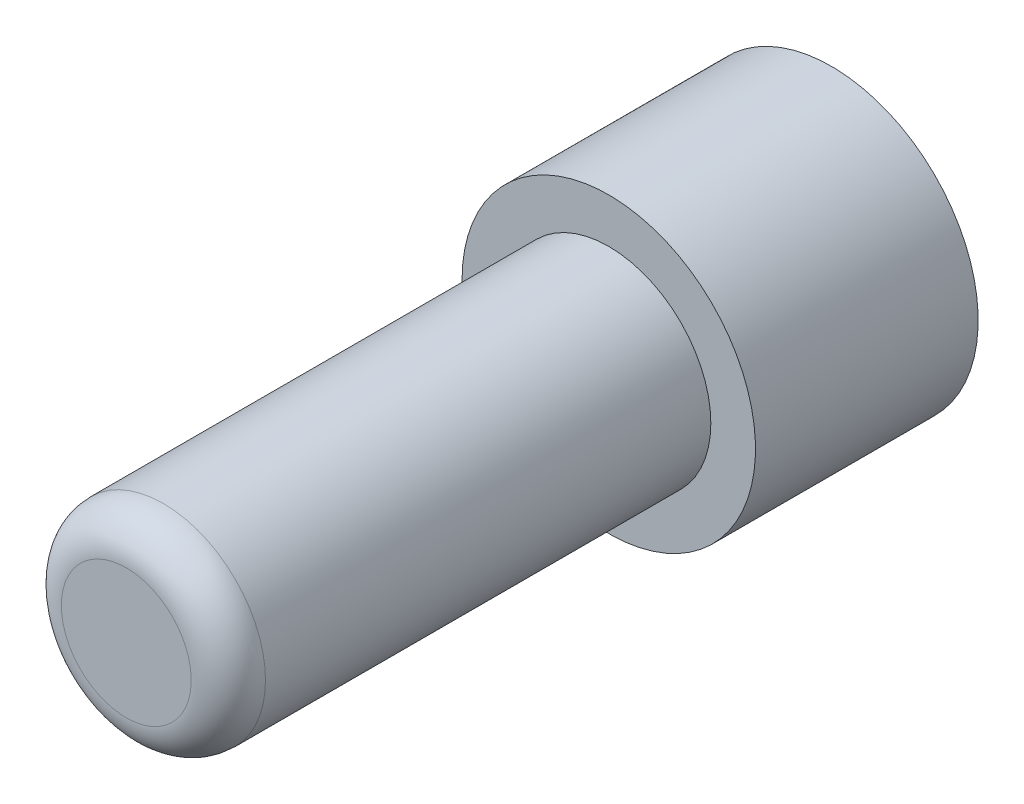
ISO-10303-21;
HEADER;
FILE_DESCRIPTION(('STEP AP214'),'2;1');
FILE_NAME('part.step','',(''),(''),'','','');
FILE_SCHEMA(('AUTOMOTIVE_DESIGN { 1 0 10303 214 1 1 1 1 }'));
ENDSEC;
DATA;
#1=APPLICATION_CONTEXT('core data for automotive mechanical design processes');
#2=APPLICATION_PROTOCOL_DEFINITION('international standard','automotive_design',2000,#1);
#3=PRODUCT_CONTEXT('',#1,'mechanical');
#4=PRODUCT('Part','Part','',(#3));
#5=PRODUCT_RELATED_PRODUCT_CATEGORY('part','',(#4));
#6=PRODUCT_DEFINITION_FORMATION('','',#4);
#7=PRODUCT_DEFINITION_CONTEXT('part definition',#1,'design');
#8=PRODUCT_DEFINITION('design','',#6,#7);
#9=PRODUCT_DEFINITION_SHAPE('','',#8);
#10=(LENGTH_UNIT() NAMED_UNIT(*) SI_UNIT(.MILLI.,.METRE.));
#11=(NAMED_UNIT(*) PLANE_ANGLE_UNIT() SI_UNIT($,.RADIAN.));
#12=(NAMED_UNIT(*) SI_UNIT($,.STERADIAN.) SOLID_ANGLE_UNIT());
#13=UNCERTAINTY_MEASURE_WITH_UNIT(LENGTH_MEASURE(1.E-05),#10,'distance_accuracy_value','');
#14=(GEOMETRIC_REPRESENTATION_CONTEXT(3) GLOBAL_UNCERTAINTY_ASSIGNED_CONTEXT((#13)) GLOBAL_UNIT_ASSIGNED_CONTEXT((#10,
#11,#12)) REPRESENTATION_CONTEXT('',''));
#15=CARTESIAN_POINT('',(0.,0.,0.));
#16=DIRECTION('',(0.,0.,1.));
#17=DIRECTION('',(1.,0.,0.));
#18=AXIS2_PLACEMENT_3D('',#15,#16,#17);
#19=CARTESIAN_POINT('',(95.8626025290754,210.063080557682,263.707141652104));
#20=DIRECTION('',(0.,0.,-1.));
#21=DIRECTION('',(-1.,0.,0.));
#22=AXIS2_PLACEMENT_3D('',#19,#20,#21);
#23=CYLINDRICAL_SURFACE('',#22,2.75000000000001);
#24=CARTESIAN_POINT('',(95.8626025290754,210.063080557682,262.707141652104));
#25=DIRECTION('',(0.,0.,-1.));
#26=DIRECTION('',(-1.,0.,0.));
#27=AXIS2_PLACEMENT_3D('',#24,#25,#26);
#28=CIRCLE('',#27,2.75000000000001);
#29=CARTESIAN_POINT('',(93.1126025290754,210.063080557682,262.707141652104));
#30=VERTEX_POINT('',#29);
#31=EDGE_CURVE('E38',#30,#30,#28,.T.);
#32=ORIENTED_EDGE('',*,*,#31,.T.);
#33=EDGE_LOOP('',(#32));
#34=FACE_BOUND('',#33,.T.);
#35=CARTESIAN_POINT('',(95.8626025290754,210.063080557682,250.707141652104));
#36=DIRECTION('',(0.,0.,-1.));
#37=DIRECTION('',(-1.,0.,0.));
#38=AXIS2_PLACEMENT_3D('',#35,#36,#37);
#39=CIRCLE('',#38,2.75000000000001);
#40=CARTESIAN_POINT('',(93.1126025290754,210.063080557682,250.707141652104));
#41=VERTEX_POINT('',#40);
#42=EDGE_CURVE('E46',#41,#41,#39,.T.);
#43=ORIENTED_EDGE('',*,*,#42,.F.);
#44=EDGE_LOOP('',(#43));
#45=FACE_BOUND('',#44,.T.);
#46=ADVANCED_FACE('F31',(#34,#45),#23,.T.);
#47=CARTESIAN_POINT('',(95.8626025290754,210.063080557682,263.707141652104));
#48=DIRECTION('',(0.,0.,-1.));
#49=DIRECTION('',(-1.,0.,0.));
#50=AXIS2_PLACEMENT_3D('',#47,#48,#49);
#51=PLANE('',#50);
#52=CARTESIAN_POINT('',(95.8626025290754,210.063080557682,263.707141652104));
#53=DIRECTION('',(0.,0.,-1.));
#54=DIRECTION('',(-1.,0.,0.));
#55=AXIS2_PLACEMENT_3D('',#52,#53,#54);
#56=CIRCLE('',#55,1.75000000000001);
#57=CARTESIAN_POINT('',(94.1126025290754,210.063080557682,263.707141652104));
#58=VERTEX_POINT('',#57);
#59=EDGE_CURVE('E10',#58,#58,#56,.F.);
#60=ORIENTED_EDGE('',*,*,#59,.T.);
#61=EDGE_LOOP('',(#60));
#62=FACE_BOUND('',#61,.T.);
#63=ADVANCED_FACE('F80',(#62),#51,.F.);
#64=CARTESIAN_POINT('',(95.8626025290754,210.063080557682,246.707141652104));
#65=DIRECTION('',(0.,0.,1.));
#66=DIRECTION('',(1.,0.,0.));
#67=AXIS2_PLACEMENT_3D('',#64,#65,#66);
#68=CYLINDRICAL_SURFACE('',#67,3.95284707521048);
#69=CARTESIAN_POINT('',(95.8626025290754,210.063080557682,250.707141652104));
#70=DIRECTION('',(0.,0.,-1.));
#71=DIRECTION('',(-1.,0.,0.));
#72=AXIS2_PLACEMENT_3D('',#69,#70,#71);
#73=CIRCLE('',#72,3.95284707521048);
#74=CARTESIAN_POINT('',(91.9097554538649,210.063080557682,250.707141652104));
#75=VERTEX_POINT('',#74);
#76=EDGE_CURVE('E51',#75,#75,#73,.T.);
#77=ORIENTED_EDGE('',*,*,#76,.T.);
#78=EDGE_LOOP('',(#77));
#79=FACE_BOUND('',#78,.T.);
#80=CARTESIAN_POINT('',(95.8626025290754,210.063080557682,244.707141652104));
#81=DIRECTION('',(0.,0.,-1.));
#82=DIRECTION('',(-1.,0.,0.));
#83=AXIS2_PLACEMENT_3D('',#80,#81,#82);
#84=CIRCLE('',#83,3.95284707521048);
#85=CARTESIAN_POINT('',(91.9097554538649,210.063080557682,244.707141652104));
#86=VERTEX_POINT('',#85);
#87=EDGE_CURVE('E54',#86,#86,#84,.T.);
#88=ORIENTED_EDGE('',*,*,#87,.F.);
#89=EDGE_LOOP('',(#88));
#90=FACE_BOUND('',#89,.T.);
#91=ADVANCED_FACE('F75',(#79,#90),#68,.T.);
#92=CARTESIAN_POINT('',(95.8626025290754,210.063080557682,250.707141652104));
#93=DIRECTION('',(0.,0.,-1.));
#94=DIRECTION('',(-1.,0.,0.));
#95=AXIS2_PLACEMENT_3D('',#92,#93,#94);
#96=PLANE('',#95);
#97=ORIENTED_EDGE('',*,*,#42,.T.);
#98=EDGE_LOOP('',(#97));
#99=FACE_BOUND('',#98,.T.);
#100=ORIENTED_EDGE('',*,*,#76,.F.);
#101=EDGE_LOOP('',(#100));
#102=FACE_BOUND('',#101,.T.);
#103=ADVANCED_FACE('F66',(#99,#102),#96,.F.);
#104=CARTESIAN_POINT('',(95.8626025290754,210.063080557682,244.707141652104));
#105=DIRECTION('',(0.,0.,-1.));
#106=DIRECTION('',(-1.,0.,0.));
#107=AXIS2_PLACEMENT_3D('',#104,#105,#106);
#108=PLANE('',#107);
#109=ORIENTED_EDGE('',*,*,#87,.T.);
#110=EDGE_LOOP('',(#109));
#111=FACE_BOUND('',#110,.T.);
#112=CARTESIAN_POINT('',(95.8626025290754,210.063080557682,244.707141652104));
#113=DIRECTION('',(0.,0.,-1.));
#114=DIRECTION('',(-1.,0.,0.));
#115=AXIS2_PLACEMENT_3D('',#112,#113,#114);
#116=CIRCLE('',#115,2.);
#117=CARTESIAN_POINT('',(93.8626025290754,210.063080557682,244.707141652104));
#118=VERTEX_POINT('',#117);
#119=EDGE_CURVE('E57',#118,#118,#116,.T.);
#120=ORIENTED_EDGE('',*,*,#119,.F.);
#121=EDGE_LOOP('',(#120));
#122=FACE_BOUND('',#121,.T.);
#123=ADVANCED_FACE('F64',(#111,#122),#108,.T.);
#124=CARTESIAN_POINT('',(95.8626025290754,210.063080557682,244.707141652104));
#125=DIRECTION('',(0.,0.,1.));
#126=DIRECTION('',(1.,0.,0.));
#127=AXIS2_PLACEMENT_3D('',#124,#125,#126);
#128=CYLINDRICAL_SURFACE('',#127,2.);
#129=ORIENTED_EDGE('',*,*,#119,.T.);
#130=EDGE_LOOP('',(#129));
#131=FACE_BOUND('',#130,.T.);
#132=CARTESIAN_POINT('',(95.8626025290754,210.063080557682,246.707141652104));
#133=DIRECTION('',(0.,0.,-1.));
#134=DIRECTION('',(-1.,0.,0.));
#135=AXIS2_PLACEMENT_3D('',#132,#133,#134);
#136=CIRCLE('',#135,2.);
#137=CARTESIAN_POINT('',(93.8626025290754,210.063080557682,246.707141652104));
#138=VERTEX_POINT('',#137);
#139=EDGE_CURVE('E42',#138,#138,#136,.F.);
#140=ORIENTED_EDGE('',*,*,#139,.T.);
#141=EDGE_LOOP('',(#140));
#142=FACE_BOUND('',#141,.T.);
#143=ADVANCED_FACE('F61',(#131,#142),#128,.F.);
#144=CARTESIAN_POINT('',(95.8626025290754,210.063080557682,246.707141652104));
#145=DIRECTION('',(0.,0.,-1.));
#146=DIRECTION('',(-1.,0.,0.));
#147=AXIS2_PLACEMENT_3D('',#144,#145,#146);
#148=PLANE('',#147);
#149=ORIENTED_EDGE('',*,*,#139,.F.);
#150=EDGE_LOOP('',(#149));
#151=FACE_BOUND('',#150,.T.);
#152=ADVANCED_FACE('F73',(#151),#148,.T.);
#153=CARTESIAN_POINT('',(95.8626025290754,210.063080557682,262.707141652104));
#154=DIRECTION('',(0.,0.,-1.));
#155=DIRECTION('',(-1.,0.,0.));
#156=AXIS2_PLACEMENT_3D('',#153,#154,#155);
#157=TOROIDAL_SURFACE('',#156,1.75000000000001,1.);
#158=ORIENTED_EDGE('',*,*,#59,.F.);
#159=EDGE_LOOP('',(#158));
#160=FACE_BOUND('',#159,.T.);
#161=ORIENTED_EDGE('',*,*,#31,.F.);
#162=EDGE_LOOP('',(#161));
#163=FACE_BOUND('',#162,.T.);
#164=ADVANCED_FACE('F33',(#160,#163),#157,.T.);
#165=CLOSED_SHELL('',(#46,#63,#91,#103,#123,#143,#152,#164));
#166=MANIFOLD_SOLID_BREP('B2',#165);
#167=ADVANCED_BREP_SHAPE_REPRESENTATION('',(#18,#166),#14);
#168=SHAPE_DEFINITION_REPRESENTATION(#9,#167);
ENDSEC;
END-ISO-10303-21;
